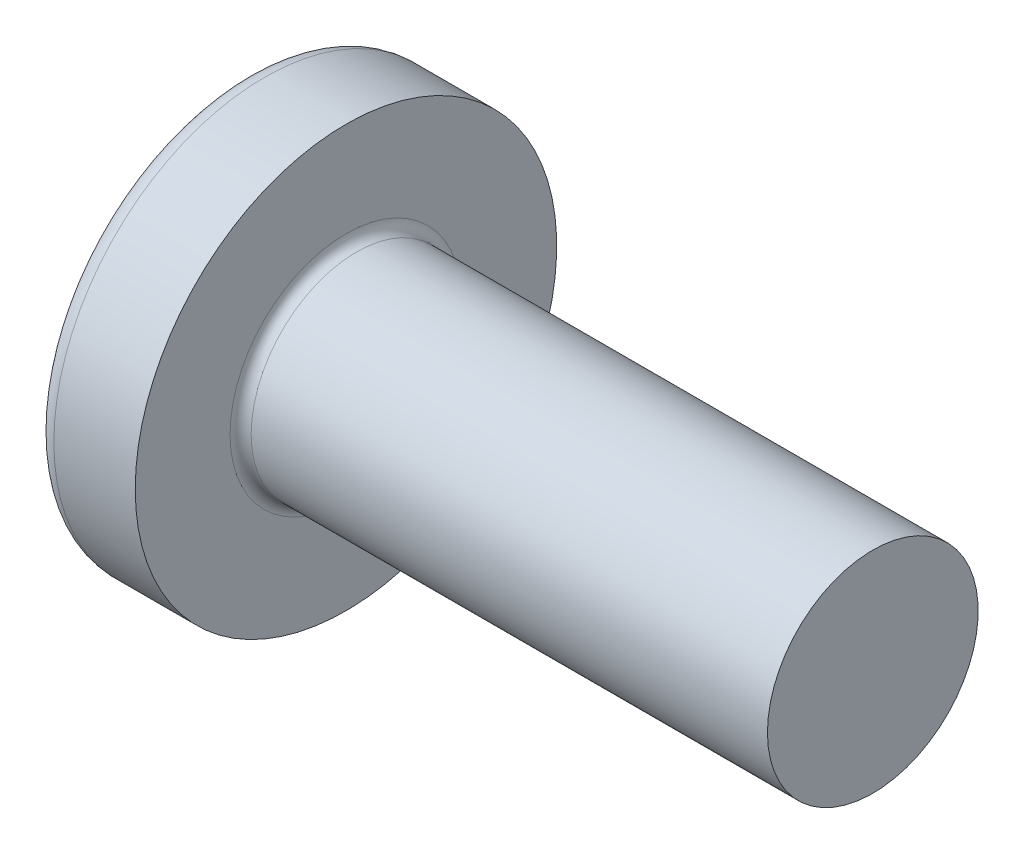
ISO-10303-21;
HEADER;
FILE_DESCRIPTION(('STEP AP214'),'2;1');
FILE_NAME('part.step','',(''),(''),'','','');
FILE_SCHEMA(('AUTOMOTIVE_DESIGN { 1 0 10303 214 1 1 1 1 }'));
ENDSEC;
DATA;
#1=APPLICATION_CONTEXT('core data for automotive mechanical design processes');
#2=APPLICATION_PROTOCOL_DEFINITION('international standard','automotive_design',2000,#1);
#3=PRODUCT_CONTEXT('',#1,'mechanical');
#4=PRODUCT('Part','Part','',(#3));
#5=PRODUCT_RELATED_PRODUCT_CATEGORY('part','',(#4));
#6=PRODUCT_DEFINITION_FORMATION('','',#4);
#7=PRODUCT_DEFINITION_CONTEXT('part definition',#1,'design');
#8=PRODUCT_DEFINITION('design','',#6,#7);
#9=PRODUCT_DEFINITION_SHAPE('','',#8);
#10=(LENGTH_UNIT() NAMED_UNIT(*) SI_UNIT(.MILLI.,.METRE.));
#11=(NAMED_UNIT(*) PLANE_ANGLE_UNIT() SI_UNIT($,.RADIAN.));
#12=(NAMED_UNIT(*) SI_UNIT($,.STERADIAN.) SOLID_ANGLE_UNIT());
#13=UNCERTAINTY_MEASURE_WITH_UNIT(LENGTH_MEASURE(1.E-05),#10,'distance_accuracy_value','');
#14=(GEOMETRIC_REPRESENTATION_CONTEXT(3) GLOBAL_UNCERTAINTY_ASSIGNED_CONTEXT((#13)) GLOBAL_UNIT_ASSIGNED_CONTEXT((#10,
#11,#12)) REPRESENTATION_CONTEXT('',''));
#15=CARTESIAN_POINT('',(0.,0.,0.));
#16=DIRECTION('',(0.,0.,1.));
#17=DIRECTION('',(1.,0.,0.));
#18=AXIS2_PLACEMENT_3D('',#15,#16,#17);
#19=CARTESIAN_POINT('',(6.5,0.,0.));
#20=DIRECTION('',(-1.,0.,0.));
#21=DIRECTION('',(0.,1.,0.));
#22=AXIS2_PLACEMENT_3D('',#19,#20,#21);
#23=SPHERICAL_SURFACE('',#22,6.5);
#24=CARTESIAN_POINT('',(1.26538895452803,0.,0.));
#25=DIRECTION('',(-1.,0.,0.));
#26=DIRECTION('',(0.,0.,1.));
#27=AXIS2_PLACEMENT_3D('',#24,#25,#26);
#28=CIRCLE('',#27,3.85342019543974);
#29=CARTESIAN_POINT('',(1.26538895452803,0.,3.85342019543974));
#30=VERTEX_POINT('',#29);
#31=EDGE_CURVE('E220',#30,#30,#28,.T.);
#32=ORIENTED_EDGE('',*,*,#31,.T.);
#33=EDGE_LOOP('',(#32));
#34=FACE_BOUND('',#33,.T.);
#35=CARTESIAN_POINT('',(0.0788099820016276,0.,0.));
#36=DIRECTION('',(1.,0.,0.));
#37=DIRECTION('',(0.,0.,-1.));
#38=AXIS2_PLACEMENT_3D('',#35,#36,#37);
#39=CIRCLE('',#38,1.0091178091571);
#40=CARTESIAN_POINT('',(0.0788099820016247,-0.514999999999996,-0.867809744562728));
#41=VERTEX_POINT('',#40);
#42=CARTESIAN_POINT('',(0.0788099820016271,-0.867809744562737,-0.515));
#43=VERTEX_POINT('',#42);
#44=EDGE_CURVE('E347',#41,#43,#39,.F.);
#45=ORIENTED_EDGE('',*,*,#44,.F.);
#46=CARTESIAN_POINT('',(6.5,-0.515,0.));
#47=DIRECTION('',(0.,1.,0.));
#48=DIRECTION('',(0.,0.,1.));
#49=AXIS2_PLACEMENT_3D('',#46,#47,#48);
#50=CIRCLE('',#49,6.47956595768575);
#51=CARTESIAN_POINT('',(0.331830520157865,-0.514999999999992,-1.98455543332606));
#52=VERTEX_POINT('',#51);
#53=EDGE_CURVE('E280',#52,#41,#50,.T.);
#54=ORIENTED_EDGE('',*,*,#53,.F.);
#55=CARTESIAN_POINT('',(6.06443225879636,0.,0.873613881877687));
#56=DIRECTION('',(0.446197753347362,0.,-0.89493439139848));
#57=DIRECTION('',(-0.89493439139848,0.,-0.446197753347362));
#58=AXIS2_PLACEMENT_3D('',#55,#56,#57);
#59=CIRCLE('',#58,6.42628038045442);
#60=CARTESIAN_POINT('',(0.331830520157865,0.515000000000007,-1.98455543332606));
#61=VERTEX_POINT('',#60);
#62=EDGE_CURVE('E254',#52,#61,#59,.T.);
#63=ORIENTED_EDGE('',*,*,#62,.T.);
#64=CARTESIAN_POINT('',(6.5,0.515,0.));
#65=DIRECTION('',(0.,-1.,0.));
#66=DIRECTION('',(0.,0.,-1.));
#67=AXIS2_PLACEMENT_3D('',#64,#65,#66);
#68=CIRCLE('',#67,6.47956595768575);
#69=CARTESIAN_POINT('',(0.0788099820016249,0.515000000000003,-0.867809744562724));
#70=VERTEX_POINT('',#69);
#71=EDGE_CURVE('E309',#70,#61,#68,.T.);
#72=ORIENTED_EDGE('',*,*,#71,.F.);
#73=CARTESIAN_POINT('',(0.0788099820016271,0.867809744562734,-0.515));
#74=VERTEX_POINT('',#73);
#75=EDGE_CURVE('E362',#74,#70,#39,.F.);
#76=ORIENTED_EDGE('',*,*,#75,.F.);
#77=CARTESIAN_POINT('',(6.5,0.,-0.515));
#78=DIRECTION('',(0.,0.,1.));
#79=DIRECTION('',(0.,-1.,0.));
#80=AXIS2_PLACEMENT_3D('',#77,#78,#79);
#81=CIRCLE('',#80,6.47956595768575);
#82=CARTESIAN_POINT('',(0.331830520157846,1.984555433326,-0.515));
#83=VERTEX_POINT('',#82);
#84=EDGE_CURVE('E248',#83,#74,#81,.T.);
#85=ORIENTED_EDGE('',*,*,#84,.F.);
#86=CARTESIAN_POINT('',(6.06443225879571,-0.87361388187862,0.));
#87=DIRECTION('',(0.44619775334751,0.894934391398406,0.));
#88=DIRECTION('',(-0.894934391398405,0.44619775334751,0.));
#89=AXIS2_PLACEMENT_3D('',#86,#87,#88);
#90=CIRCLE('',#89,6.42628038045425);
#91=CARTESIAN_POINT('',(0.331830520157846,1.984555433326,0.515));
#92=VERTEX_POINT('',#91);
#93=EDGE_CURVE('E251',#83,#92,#90,.T.);
#94=ORIENTED_EDGE('',*,*,#93,.T.);
#95=CARTESIAN_POINT('',(6.5,0.,0.515));
#96=DIRECTION('',(0.,0.,-1.));
#97=DIRECTION('',(0.,1.,0.));
#98=AXIS2_PLACEMENT_3D('',#95,#96,#97);
#99=CIRCLE('',#98,6.47956595768575);
#100=CARTESIAN_POINT('',(0.0788099820016271,0.867809744562734,0.515));
#101=VERTEX_POINT('',#100);
#102=EDGE_CURVE('E244',#101,#92,#99,.T.);
#103=ORIENTED_EDGE('',*,*,#102,.F.);
#104=CARTESIAN_POINT('',(0.0788099820016247,0.514999999999997,0.867809744562727));
#105=VERTEX_POINT('',#104);
#106=EDGE_CURVE('E361',#105,#101,#39,.F.);
#107=ORIENTED_EDGE('',*,*,#106,.F.);
#108=CARTESIAN_POINT('',(0.331830520157846,0.514999999999993,1.984555433326));
#109=VERTEX_POINT('',#108);
#110=EDGE_CURVE('E264',#109,#105,#68,.T.);
#111=ORIENTED_EDGE('',*,*,#110,.F.);
#112=CARTESIAN_POINT('',(6.06443225879571,0.,-0.87361388187862));
#113=DIRECTION('',(0.44619775334751,0.,0.894934391398406));
#114=DIRECTION('',(0.894934391398405,0.,-0.44619775334751));
#115=AXIS2_PLACEMENT_3D('',#112,#113,#114);
#116=CIRCLE('',#115,6.42628038045425);
#117=CARTESIAN_POINT('',(0.331830520157846,-0.515000000000007,1.984555433326));
#118=VERTEX_POINT('',#117);
#119=EDGE_CURVE('E55',#109,#118,#116,.T.);
#120=ORIENTED_EDGE('',*,*,#119,.T.);
#121=CARTESIAN_POINT('',(0.078809982001625,-0.515000000000003,0.867809744562724));
#122=VERTEX_POINT('',#121);
#123=EDGE_CURVE('E261',#122,#118,#50,.T.);
#124=ORIENTED_EDGE('',*,*,#123,.F.);
#125=CARTESIAN_POINT('',(0.0788099820016271,-0.867809744562737,0.514999999999999));
#126=VERTEX_POINT('',#125);
#127=EDGE_CURVE('E397',#126,#122,#39,.F.);
#128=ORIENTED_EDGE('',*,*,#127,.F.);
#129=CARTESIAN_POINT('',(0.331830520157864,-1.98455543332606,0.514999999999999));
#130=VERTEX_POINT('',#129);
#131=EDGE_CURVE('E245',#130,#126,#99,.T.);
#132=ORIENTED_EDGE('',*,*,#131,.F.);
#133=CARTESIAN_POINT('',(6.06443225879636,0.873613881877687,0.));
#134=DIRECTION('',(0.446197753347362,-0.89493439139848,0.));
#135=DIRECTION('',(0.89493439139848,0.446197753347362,0.));
#136=AXIS2_PLACEMENT_3D('',#133,#134,#135);
#137=CIRCLE('',#136,6.42628038045442);
#138=CARTESIAN_POINT('',(0.331830520157864,-1.98455543332606,-0.515));
#139=VERTEX_POINT('',#138);
#140=EDGE_CURVE('E241',#130,#139,#137,.T.);
#141=ORIENTED_EDGE('',*,*,#140,.T.);
#142=EDGE_CURVE('E70',#43,#139,#81,.T.);
#143=ORIENTED_EDGE('',*,*,#142,.F.);
#144=EDGE_LOOP('',(#45,#54,#63,#72,#76,#85,#94,#103,#107,#111,#120,#124,#128,#132,#141,#143));
#145=FACE_BOUND('',#144,.T.);
#146=ADVANCED_FACE('F41',(#34,#145),#23,.T.);
#147=CARTESIAN_POINT('',(0.,2.15,-0.515));
#148=DIRECTION('',(0.,0.,1.));
#149=DIRECTION('',(0.,-1.,0.));
#150=AXIS2_PLACEMENT_3D('',#147,#148,#149);
#151=PLANE('',#150);
#152=ORIENTED_EDGE('',*,*,#84,.T.);
#153=CARTESIAN_POINT('',(-1.51195208754037,0.994972220382297,-0.515));
#154=CARTESIAN_POINT('',(-1.20405982018868,0.970722017005064,-0.515));
#155=CARTESIAN_POINT('',(-0.896180908124144,0.946299109967688,-0.515));
#156=CARTESIAN_POINT('',(-0.280449080249312,0.896981122461527,-0.515));
#157=CARTESIAN_POINT('',(0.0274038341154851,0.872086023961265,-0.515));
#158=CARTESIAN_POINT('',(0.489146739371409,0.834295535207136,-0.515));
#159=CARTESIAN_POINT('',(0.643055047497245,0.821624058408796,-0.515));
#160=CARTESIAN_POINT('',(0.950856520315203,0.796108332629705,-0.515));
#161=CARTESIAN_POINT('',(1.10474968508407,0.783264084575317,-0.515));
#162=CARTESIAN_POINT('',(1.41251352133103,0.757376569061287,-0.515));
#163=CARTESIAN_POINT('',(1.56638419343305,0.744333309025534,-0.515));
#164=CARTESIAN_POINT('',(1.87410847407519,0.718013273133716,-0.515));
#165=CARTESIAN_POINT('',(2.02796208224283,0.704736492919709,-0.515));
#166=CARTESIAN_POINT('',(2.36455311972626,0.675386942934955,-0.515));
#167=CARTESIAN_POINT('',(2.5472856237498,0.659257575568568,-0.515));
#168=CARTESIAN_POINT('',(2.91270624190895,0.626517182406014,-0.515));
#169=CARTESIAN_POINT('',(3.09539435635676,0.609906160102554,-0.515));
#170=CARTESIAN_POINT('',(3.46069832273244,0.576073027039889,-0.515));
#171=CARTESIAN_POINT('',(3.64331417951694,0.558850968855157,-0.515));
#172=CARTESIAN_POINT('',(4.00847437578178,0.523604864460044,-0.515));
#173=CARTESIAN_POINT('',(4.1910187129849,0.505580794522876,-0.515));
#174=CARTESIAN_POINT('',(4.55606208239525,0.46842919158178,-0.515));
#175=CARTESIAN_POINT('',(4.73856107439606,0.449301262195198,-0.515));
#176=CARTESIAN_POINT('',(5.10337547434977,0.409473604657435,-0.515));
#177=CARTESIAN_POINT('',(5.2856908960796,0.388774005011695,-0.515));
#178=CARTESIAN_POINT('',(5.55897278576906,0.355828287427083,-0.515));
#179=CARTESIAN_POINT('',(5.65005277501166,0.344527918680369,-0.515));
#180=CARTESIAN_POINT('',(5.83209904185046,0.3210751741555,-0.515));
#181=CARTESIAN_POINT('',(5.92306532479326,0.308922840099181,-0.515));
#182=CARTESIAN_POINT('',(6.10486078954238,0.283427334334153,-0.515));
#183=CARTESIAN_POINT('',(6.19568992380675,0.270083817479638,-0.515));
#184=CARTESIAN_POINT('',(6.33172773866873,0.24870142067948,-0.515));
#185=CARTESIAN_POINT('',(6.37704304554499,0.241345446571708,-0.515));
#186=CARTESIAN_POINT('',(6.46757225282465,0.226018953418424,-0.515));
#187=CARTESIAN_POINT('',(6.51278614649077,0.218048394719369,-0.515));
#188=CARTESIAN_POINT('',(6.55793125840465,0.209691465124902,-0.515));
#189=B_SPLINE_CURVE_WITH_KNOTS('',3,(#153,#154,#155,#156,#157,#158,#159,#160,#161,#162,#163,
#164,#165,#166,#167,#168,#169,#170,#171,#172,#173,#174,#175,#176,#177,#178,#179,#180,#181,#182,
#183,#184,#185,#186,#187,#188),.UNSPECIFIED.,.F.,.F.,(4,2,2,2,2,2,2,2,2,2,2,2,2,2,2,2,2,4),(0.,
0.926537710061278,1.85311087314258,2.31639796098494,2.77968256577269,3.24294993036838,
3.70622594962848,4.25655436226469,4.80687878520654,5.3571559716686,5.90744944841854,
6.45794177358856,7.00838913688618,7.28372117498156,7.55903973911883,7.83443833749095,
7.97216007622235,8.10989070832989),.UNSPECIFIED.);
#190=CARTESIAN_POINT('',(2.34,0.677477674908923,-0.515));
#191=VERTEX_POINT('',#190);
#192=EDGE_CURVE('E384',#74,#191,#189,.T.);
#193=ORIENTED_EDGE('',*,*,#192,.T.);
#194=DIRECTION('',(0.,1.,0.));
#195=VECTOR('',#194,1.);
#196=CARTESIAN_POINT('',(2.34,-0.983319232260985,-0.515));
#197=LINE('',#196,#195);
#198=CARTESIAN_POINT('',(2.34,0.9833192322605,-0.515));
#199=VERTEX_POINT('',#198);
#200=EDGE_CURVE('E330',#191,#199,#197,.T.);
#201=ORIENTED_EDGE('',*,*,#200,.T.);
#202=DIRECTION('',(0.894934391398405,-0.44619775334751,0.));
#203=VECTOR('',#202,1.);
#204=CARTESIAN_POINT('',(0.,2.15,-0.515));
#205=LINE('',#204,#203);
#206=EDGE_CURVE('E221',#83,#199,#205,.T.);
#207=ORIENTED_EDGE('',*,*,#206,.F.);
#208=EDGE_LOOP('',(#152,#193,#201,#207));
#209=FACE_BOUND('',#208,.T.);
#210=ADVANCED_FACE('F176',(#209),#151,.T.);
#211=CARTESIAN_POINT('',(2.34,-0.983319232260985,-0.515));
#212=VERTEX_POINT('',#211);
#213=CARTESIAN_POINT('',(2.34,-0.677477674908923,-0.515));
#214=VERTEX_POINT('',#213);
#215=EDGE_CURVE('E229',#212,#214,#197,.T.);
#216=ORIENTED_EDGE('',*,*,#215,.T.);
#217=CARTESIAN_POINT('',(-1.51195208675156,-0.994972220320187,-0.515));
#218=CARTESIAN_POINT('',(-1.20405981949279,-0.970722016949958,-0.515));
#219=CARTESIAN_POINT('',(-0.896180907521173,-0.946299109919651,-0.515));
#220=CARTESIAN_POINT('',(-0.280449079832185,-0.896981122427851,-0.515));
#221=CARTESIAN_POINT('',(0.0274038344396873,-0.872086023934883,-0.515));
#222=CARTESIAN_POINT('',(0.489146739515351,-0.83429553519528,-0.515));
#223=CARTESIAN_POINT('',(0.643055047553846,-0.821624058404092,-0.515));
#224=CARTESIAN_POINT('',(0.950856520197141,-0.796108332639504,-0.515));
#225=CARTESIAN_POINT('',(1.10474968487868,-0.783264084592465,-0.515));
#226=CARTESIAN_POINT('',(1.41251352095103,-0.757376569093378,-0.515));
#227=CARTESIAN_POINT('',(1.56638419296577,-0.744333309065218,-0.515));
#228=CARTESIAN_POINT('',(1.87410847343335,-0.718013273188896,-0.515));
#229=CARTESIAN_POINT('',(2.02796208151372,-0.704736492982792,-0.515));
#230=CARTESIAN_POINT('',(2.36455311890989,-0.675386943006726,-0.515));
#231=CARTESIAN_POINT('',(2.54728562293342,-0.659257575640986,-0.515));
#232=CARTESIAN_POINT('',(2.91270624109256,-0.626517182479888,-0.515));
#233=CARTESIAN_POINT('',(3.09539435554038,-0.609906160177238,-0.515));
#234=CARTESIAN_POINT('',(3.46069832191613,-0.576073027116421,-0.515));
#235=CARTESIAN_POINT('',(3.64331417870068,-0.558850968932727,-0.515));
#236=CARTESIAN_POINT('',(4.00847437496567,-0.523604864540037,-0.515));
#237=CARTESIAN_POINT('',(4.19101871216888,-0.505580794604253,-0.515));
#238=CARTESIAN_POINT('',(4.55606208157937,-0.468429191666488,-0.515));
#239=CARTESIAN_POINT('',(4.73856107358023,-0.449301262281853,-0.515));
#240=CARTESIAN_POINT('',(5.10337547353419,-0.409473604748924,-0.515));
#241=CARTESIAN_POINT('',(5.28569089526422,-0.388774005106069,-0.515));
#242=CARTESIAN_POINT('',(5.55897278495412,-0.355828287527264,-0.515));
#243=CARTESIAN_POINT('',(5.65005277419686,-0.344527918782738,-0.515));
#244=CARTESIAN_POINT('',(5.83209904103608,-0.321075174263031,-0.515));
#245=CARTESIAN_POINT('',(5.92306532397915,-0.308922840209686,-0.515));
#246=CARTESIAN_POINT('',(6.10486078872898,-0.28342733445193,-0.515));
#247=CARTESIAN_POINT('',(6.1956899229938,-0.270083817601714,-0.515));
#248=CARTESIAN_POINT('',(6.33172773785679,-0.248701420809951,-0.515));
#249=CARTESIAN_POINT('',(6.37704304473344,-0.241345446705304,-0.515));
#250=CARTESIAN_POINT('',(6.4675722520141,-0.226018953559338,-0.515));
#251=CARTESIAN_POINT('',(6.51278614568083,-0.218048394864476,-0.515));
#252=CARTESIAN_POINT('',(6.55793125759549,-0.209691465274944,-0.515));
#253=B_SPLINE_CURVE_WITH_KNOTS('',3,(#217,#218,#219,#220,#221,#222,#223,#224,#225,#226,#227,
#228,#229,#230,#231,#232,#233,#234,#235,#236,#237,#238,#239,#240,#241,#242,#243,#244,#245,#246,
#247,#248,#249,#250,#251,#252),.UNSPECIFIED.,.F.,.F.,(4,2,2,2,2,2,2,2,2,2,2,2,2,2,2,2,2,4),(0.,
0.92653770978172,1.85311087258339,2.31639796016285,2.77968256468771,3.24294992902054,
3.70622594801777,4.25655436065378,4.80687878359543,5.35715597005738,5.90744944680718,
6.45794177197673,7.008389135274,7.28372117336899,7.55903973750591,7.83443833587749,
7.97216007460855,8.10989070671571),.UNSPECIFIED.);
#254=EDGE_CURVE('E360',#214,#43,#253,.F.);
#255=ORIENTED_EDGE('',*,*,#254,.T.);
#256=ORIENTED_EDGE('',*,*,#142,.T.);
#257=DIRECTION('',(0.894934391398479,0.446197753347362,0.));
#258=VECTOR('',#257,1.);
#259=CARTESIAN_POINT('',(0.,-2.15,-0.515));
#260=LINE('',#259,#258);
#261=EDGE_CURVE('E312',#139,#212,#260,.T.);
#262=ORIENTED_EDGE('',*,*,#261,.T.);
#263=EDGE_LOOP('',(#216,#255,#256,#262));
#264=FACE_BOUND('',#263,.T.);
#265=ADVANCED_FACE('F182',(#264),#151,.T.);
#266=CARTESIAN_POINT('',(0.,-2.15,0.514999999999999));
#267=DIRECTION('',(0.,0.,-1.));
#268=DIRECTION('',(0.,1.,0.));
#269=AXIS2_PLACEMENT_3D('',#266,#267,#268);
#270=PLANE('',#269);
#271=DIRECTION('',(0.,-1.,0.));
#272=VECTOR('',#271,1.);
#273=CARTESIAN_POINT('',(2.34,0.9833192322605,0.515));
#274=LINE('',#273,#272);
#275=CARTESIAN_POINT('',(2.34,0.9833192322605,0.515));
#276=VERTEX_POINT('',#275);
#277=CARTESIAN_POINT('',(2.34,0.677477674908923,0.515));
#278=VERTEX_POINT('',#277);
#279=EDGE_CURVE('E320',#276,#278,#274,.T.);
#280=ORIENTED_EDGE('',*,*,#279,.T.);
#281=CARTESIAN_POINT('',(-1.51195208754037,0.994972220382298,0.515));
#282=CARTESIAN_POINT('',(-1.20405982018868,0.970722017005064,0.514999999999999));
#283=CARTESIAN_POINT('',(-0.896180908124144,0.946299109967689,0.515));
#284=CARTESIAN_POINT('',(-0.280449080249312,0.896981122461527,0.515));
#285=CARTESIAN_POINT('',(0.0274038341154852,0.872086023961265,0.515));
#286=CARTESIAN_POINT('',(0.489146739371409,0.834295535207136,0.515));
#287=CARTESIAN_POINT('',(0.643055047497245,0.821624058408796,0.515));
#288=CARTESIAN_POINT('',(0.950856520315204,0.796108332629706,0.515));
#289=CARTESIAN_POINT('',(1.10474968508407,0.783264084575317,0.515));
#290=CARTESIAN_POINT('',(1.41251352133103,0.757376569061287,0.515));
#291=CARTESIAN_POINT('',(1.56638419343305,0.744333309025534,0.515));
#292=CARTESIAN_POINT('',(1.87410847407519,0.718013273133716,0.515));
#293=CARTESIAN_POINT('',(2.02796208224283,0.70473649291971,0.515));
#294=CARTESIAN_POINT('',(2.36455311972626,0.675386942934956,0.515));
#295=CARTESIAN_POINT('',(2.5472856237498,0.659257575568568,0.515));
#296=CARTESIAN_POINT('',(2.91270624190895,0.626517182406014,0.515));
#297=CARTESIAN_POINT('',(3.09539435635676,0.609906160102555,0.515));
#298=CARTESIAN_POINT('',(3.46069832273244,0.576073027039889,0.515));
#299=CARTESIAN_POINT('',(3.64331417951694,0.558850968855157,0.515));
#300=CARTESIAN_POINT('',(4.00847437578178,0.523604864460044,0.515));
#301=CARTESIAN_POINT('',(4.1910187129849,0.505580794522876,0.515));
#302=CARTESIAN_POINT('',(4.55606208239526,0.46842919158178,0.515));
#303=CARTESIAN_POINT('',(4.73856107439606,0.449301262195198,0.515));
#304=CARTESIAN_POINT('',(5.10337547434977,0.409473604657435,0.515));
#305=CARTESIAN_POINT('',(5.28569089607961,0.388774005011695,0.515));
#306=CARTESIAN_POINT('',(5.55897278576906,0.355828287427082,0.515));
#307=CARTESIAN_POINT('',(5.65005277501166,0.344527918680369,0.515));
#308=CARTESIAN_POINT('',(5.83209904185046,0.3210751741555,0.515));
#309=CARTESIAN_POINT('',(5.92306532479326,0.308922840099181,0.515));
#310=CARTESIAN_POINT('',(6.10486078954238,0.283427334334153,0.515));
#311=CARTESIAN_POINT('',(6.19568992380676,0.270083817479637,0.515));
#312=CARTESIAN_POINT('',(6.33172773866874,0.248701420679479,0.515));
#313=CARTESIAN_POINT('',(6.377043045545,0.241345446571707,0.515));
#314=CARTESIAN_POINT('',(6.46757225282466,0.226018953418423,0.515));
#315=CARTESIAN_POINT('',(6.51278614649077,0.218048394719368,0.515));
#316=CARTESIAN_POINT('',(6.55793125840465,0.209691465124901,0.515));
#317=B_SPLINE_CURVE_WITH_KNOTS('',3,(#281,#282,#283,#284,#285,#286,#287,#288,#289,#290,#291,
#292,#293,#294,#295,#296,#297,#298,#299,#300,#301,#302,#303,#304,#305,#306,#307,#308,#309,#310,
#311,#312,#313,#314,#315,#316),.UNSPECIFIED.,.F.,.F.,(4,2,2,2,2,2,2,2,2,2,2,2,2,2,2,2,2,4),(0.,
0.926537710061278,1.85311087314258,2.31639796098494,2.77968256577269,3.24294993036838,
3.70622594962848,4.25655436226469,4.80687878520654,5.3571559716686,5.90744944841855,
6.45794177358856,7.00838913688619,7.28372117498157,7.55903973911884,7.83443833749096,
7.97216007622236,8.10989070832989),.UNSPECIFIED.);
#318=EDGE_CURVE('E285',#278,#101,#317,.F.);
#319=ORIENTED_EDGE('',*,*,#318,.T.);
#320=ORIENTED_EDGE('',*,*,#102,.T.);
#321=DIRECTION('',(0.894934391398405,-0.44619775334751,0.));
#322=VECTOR('',#321,1.);
#323=CARTESIAN_POINT('',(0.,2.15,0.515));
#324=LINE('',#323,#322);
#325=EDGE_CURVE('E226',#92,#276,#324,.T.);
#326=ORIENTED_EDGE('',*,*,#325,.T.);
#327=EDGE_LOOP('',(#280,#319,#320,#326));
#328=FACE_BOUND('',#327,.T.);
#329=ADVANCED_FACE('F380',(#328),#270,.T.);
#330=ORIENTED_EDGE('',*,*,#131,.T.);
#331=CARTESIAN_POINT('',(-1.51195208754037,-0.994972220382298,0.514999999999999));
#332=CARTESIAN_POINT('',(-1.20405982018868,-0.970722017005064,0.514999999999999));
#333=CARTESIAN_POINT('',(-0.896180908124144,-0.946299109967689,0.514999999999999));
#334=CARTESIAN_POINT('',(-0.280449080249312,-0.896981122461527,0.514999999999999));
#335=CARTESIAN_POINT('',(0.0274038341154852,-0.872086023961265,0.514999999999999));
#336=CARTESIAN_POINT('',(0.489146739371409,-0.834295535207137,0.514999999999999));
#337=CARTESIAN_POINT('',(0.643055047497245,-0.821624058408796,0.514999999999999));
#338=CARTESIAN_POINT('',(0.950856520315204,-0.796108332629706,0.514999999999999));
#339=CARTESIAN_POINT('',(1.10474968508407,-0.783264084575317,0.514999999999999));
#340=CARTESIAN_POINT('',(1.41251352133103,-0.757376569061288,0.514999999999999));
#341=CARTESIAN_POINT('',(1.56638419343305,-0.744333309025534,0.515));
#342=CARTESIAN_POINT('',(1.87410847407519,-0.718013273133716,0.515));
#343=CARTESIAN_POINT('',(2.02796208224283,-0.70473649291971,0.515));
#344=CARTESIAN_POINT('',(2.36455311972626,-0.675386942934956,0.515));
#345=CARTESIAN_POINT('',(2.5472856237498,-0.659257575568568,0.515));
#346=CARTESIAN_POINT('',(2.91270624190895,-0.626517182406014,0.515));
#347=CARTESIAN_POINT('',(3.09539435635676,-0.609906160102555,0.515));
#348=CARTESIAN_POINT('',(3.46069832273244,-0.57607302703989,0.515));
#349=CARTESIAN_POINT('',(3.64331417951693,-0.558850968855157,0.515));
#350=CARTESIAN_POINT('',(4.00847437578178,-0.523604864460045,0.515));
#351=CARTESIAN_POINT('',(4.1910187129849,-0.505580794522877,0.515));
#352=CARTESIAN_POINT('',(4.55606208239525,-0.468429191581781,0.515));
#353=CARTESIAN_POINT('',(4.73856107439606,-0.449301262195198,0.515));
#354=CARTESIAN_POINT('',(5.10337547434977,-0.409473604657435,0.515));
#355=CARTESIAN_POINT('',(5.2856908960796,-0.388774005011696,0.515));
#356=CARTESIAN_POINT('',(5.55897278576906,-0.355828287427083,0.515));
#357=CARTESIAN_POINT('',(5.65005277501166,-0.344527918680369,0.515));
#358=CARTESIAN_POINT('',(5.83209904185046,-0.3210751741555,0.515));
#359=CARTESIAN_POINT('',(5.92306532479326,-0.308922840099181,0.515));
#360=CARTESIAN_POINT('',(6.10486078954238,-0.283427334334153,0.515));
#361=CARTESIAN_POINT('',(6.19568992380675,-0.270083817479638,0.515));
#362=CARTESIAN_POINT('',(6.33172773866873,-0.24870142067948,0.515));
#363=CARTESIAN_POINT('',(6.37704304554499,-0.241345446571708,0.515));
#364=CARTESIAN_POINT('',(6.46757225282465,-0.226018953418424,0.515));
#365=CARTESIAN_POINT('',(6.51278614649077,-0.218048394719369,0.515));
#366=CARTESIAN_POINT('',(6.55793125840465,-0.209691465124902,0.515));
#367=B_SPLINE_CURVE_WITH_KNOTS('',3,(#331,#332,#333,#334,#335,#336,#337,#338,#339,#340,#341,
#342,#343,#344,#345,#346,#347,#348,#349,#350,#351,#352,#353,#354,#355,#356,#357,#358,#359,#360,
#361,#362,#363,#364,#365,#366),.UNSPECIFIED.,.F.,.F.,(4,2,2,2,2,2,2,2,2,2,2,2,2,2,2,2,2,4),(0.,
0.926537710061278,1.85311087314258,2.31639796098494,2.77968256577269,3.24294993036838,
3.70622594962848,4.25655436226469,4.80687878520654,5.3571559716686,5.90744944841854,
6.45794177358856,7.00838913688618,7.28372117498156,7.55903973911884,7.83443833749096,
7.97216007622236,8.10989070832989),.UNSPECIFIED.);
#368=CARTESIAN_POINT('',(2.34,-0.677477674908923,0.515));
#369=VERTEX_POINT('',#368);
#370=EDGE_CURVE('E398',#126,#369,#367,.T.);
#371=ORIENTED_EDGE('',*,*,#370,.T.);
#372=CARTESIAN_POINT('',(2.34,-0.983319232260985,0.515));
#373=VERTEX_POINT('',#372);
#374=EDGE_CURVE('E322',#369,#373,#274,.T.);
#375=ORIENTED_EDGE('',*,*,#374,.T.);
#376=DIRECTION('',(0.89493439139848,0.446197753347362,0.));
#377=VECTOR('',#376,1.);
#378=CARTESIAN_POINT('',(0.,-2.15,0.514999999999999));
#379=LINE('',#378,#377);
#380=EDGE_CURVE('E314',#130,#373,#379,.T.);
#381=ORIENTED_EDGE('',*,*,#380,.F.);
#382=EDGE_LOOP('',(#330,#371,#375,#381));
#383=FACE_BOUND('',#382,.T.);
#384=ADVANCED_FACE('F428',(#383),#270,.T.);
#385=CARTESIAN_POINT('',(2.34,0.9833192322605,-0.515));
#386=DIRECTION('',(-1.,0.,0.));
#387=DIRECTION('',(0.,0.,1.));
#388=AXIS2_PLACEMENT_3D('',#385,#386,#387);
#389=PLANE('',#388);
#390=ORIENTED_EDGE('',*,*,#374,.F.);
#391=CARTESIAN_POINT('',(2.34,0.,0.));
#392=DIRECTION('',(-1.,0.,0.));
#393=DIRECTION('',(0.,0.,1.));
#394=AXIS2_PLACEMENT_3D('',#391,#392,#393);
#395=CIRCLE('',#394,0.851);
#396=EDGE_CURVE('E355',#214,#369,#395,.T.);
#397=ORIENTED_EDGE('',*,*,#396,.F.);
#398=ORIENTED_EDGE('',*,*,#215,.F.);
#399=DIRECTION('',(0.,0.,1.));
#400=VECTOR('',#399,1.);
#401=CARTESIAN_POINT('',(2.34,-0.983319232260985,-0.515));
#402=LINE('',#401,#400);
#403=EDGE_CURVE('E317',#212,#373,#402,.T.);
#404=ORIENTED_EDGE('',*,*,#403,.T.);
#405=EDGE_LOOP('',(#390,#397,#398,#404));
#406=FACE_BOUND('',#405,.T.);
#407=ADVANCED_FACE('F421',(#406),#389,.T.);
#408=DIRECTION('',(0.,0.,-1.));
#409=VECTOR('',#408,1.);
#410=CARTESIAN_POINT('',(2.34,-0.515000000000003,0.983319232260498));
#411=LINE('',#410,#409);
#412=CARTESIAN_POINT('',(2.34,-0.514999999999997,-0.677477674908925));
#413=VERTEX_POINT('',#412);
#414=CARTESIAN_POINT('',(2.34,-0.514999999999996,-0.983319232260987));
#415=VERTEX_POINT('',#414);
#416=EDGE_CURVE('E303',#413,#415,#411,.T.);
#417=ORIENTED_EDGE('',*,*,#416,.F.);
#418=CARTESIAN_POINT('',(2.34,0.515000000000002,-0.677477674908921));
#419=VERTEX_POINT('',#418);
#420=EDGE_CURVE('E62',#419,#413,#395,.T.);
#421=ORIENTED_EDGE('',*,*,#420,.F.);
#422=DIRECTION('',(0.,0.,1.));
#423=VECTOR('',#422,1.);
#424=CARTESIAN_POINT('',(2.34,0.515000000000004,-0.983319232260983));
#425=LINE('',#424,#423);
#426=CARTESIAN_POINT('',(2.34,0.515000000000004,-0.983319232260983));
#427=VERTEX_POINT('',#426);
#428=EDGE_CURVE('E306',#427,#419,#425,.T.);
#429=ORIENTED_EDGE('',*,*,#428,.F.);
#430=DIRECTION('',(0.,-1.,0.));
#431=VECTOR('',#430,1.);
#432=CARTESIAN_POINT('',(2.34,0.515000000000004,-0.983319232260983));
#433=LINE('',#432,#431);
#434=EDGE_CURVE('E297',#427,#415,#433,.T.);
#435=ORIENTED_EDGE('',*,*,#434,.T.);
#436=EDGE_LOOP('',(#417,#421,#429,#435));
#437=FACE_BOUND('',#436,.T.);
#438=ADVANCED_FACE('F350',(#437),#389,.T.);
#439=ORIENTED_EDGE('',*,*,#200,.F.);
#440=EDGE_CURVE('E354',#278,#191,#395,.T.);
#441=ORIENTED_EDGE('',*,*,#440,.F.);
#442=ORIENTED_EDGE('',*,*,#279,.F.);
#443=DIRECTION('',(0.,0.,-1.));
#444=VECTOR('',#443,1.);
#445=CARTESIAN_POINT('',(2.34,0.9833192322605,0.515));
#446=LINE('',#445,#444);
#447=EDGE_CURVE('E323',#276,#199,#446,.T.);
#448=ORIENTED_EDGE('',*,*,#447,.T.);
#449=EDGE_LOOP('',(#439,#441,#442,#448));
#450=FACE_BOUND('',#449,.T.);
#451=ADVANCED_FACE('F422',(#450),#389,.T.);
#452=CARTESIAN_POINT('',(0.,0.514999999999993,2.15));
#453=DIRECTION('',(0.,-1.,0.));
#454=DIRECTION('',(0.,0.,-1.));
#455=AXIS2_PLACEMENT_3D('',#452,#453,#454);
#456=PLANE('',#455);
#457=ORIENTED_EDGE('',*,*,#110,.T.);
#458=CARTESIAN_POINT('',(-1.51195208754037,0.514999999999997,0.994972220382299));
#459=CARTESIAN_POINT('',(-1.20405982018868,0.514999999999997,0.970722017005066));
#460=CARTESIAN_POINT('',(-0.896180908124144,0.514999999999997,0.94629910996769));
#461=CARTESIAN_POINT('',(-0.280449080249312,0.514999999999997,0.896981122461529));
#462=CARTESIAN_POINT('',(0.0274038341154852,0.514999999999997,0.872086023961266));
#463=CARTESIAN_POINT('',(0.489146739371409,0.514999999999997,0.834295535207138));
#464=CARTESIAN_POINT('',(0.643055047497245,0.514999999999997,0.821624058408798));
#465=CARTESIAN_POINT('',(0.950856520315203,0.514999999999997,0.796108332629707));
#466=CARTESIAN_POINT('',(1.10474968508407,0.514999999999997,0.783264084575319));
#467=CARTESIAN_POINT('',(1.41251352133103,0.514999999999997,0.757376569061289));
#468=CARTESIAN_POINT('',(1.56638419343305,0.514999999999997,0.744333309025535));
#469=CARTESIAN_POINT('',(1.87410847407519,0.514999999999998,0.718013273133717));
#470=CARTESIAN_POINT('',(2.02796208224283,0.514999999999998,0.704736492919711));
#471=CARTESIAN_POINT('',(2.36455311972626,0.514999999999998,0.675386942934957));
#472=CARTESIAN_POINT('',(2.5472856237498,0.514999999999998,0.65925757556857));
#473=CARTESIAN_POINT('',(2.91270624190895,0.514999999999998,0.626517182406015));
#474=CARTESIAN_POINT('',(3.09539435635676,0.514999999999998,0.609906160102556));
#475=CARTESIAN_POINT('',(3.46069832273244,0.514999999999998,0.576073027039891));
#476=CARTESIAN_POINT('',(3.64331417951694,0.514999999999998,0.558850968855158));
#477=CARTESIAN_POINT('',(4.00847437578178,0.514999999999998,0.523604864460046));
#478=CARTESIAN_POINT('',(4.1910187129849,0.514999999999998,0.505580794522878));
#479=CARTESIAN_POINT('',(4.55606208239526,0.514999999999999,0.468429191581781));
#480=CARTESIAN_POINT('',(4.73856107439606,0.514999999999999,0.449301262195199));
#481=CARTESIAN_POINT('',(5.10337547434977,0.514999999999999,0.409473604657437));
#482=CARTESIAN_POINT('',(5.28569089607961,0.514999999999999,0.388774005011697));
#483=CARTESIAN_POINT('',(5.55897278576906,0.514999999999999,0.355828287427084));
#484=CARTESIAN_POINT('',(5.65005277501166,0.514999999999999,0.344527918680371));
#485=CARTESIAN_POINT('',(5.83209904185046,0.514999999999999,0.321075174155502));
#486=CARTESIAN_POINT('',(5.92306532479326,0.514999999999999,0.308922840099182));
#487=CARTESIAN_POINT('',(6.10486078954238,0.514999999999999,0.283427334334155));
#488=CARTESIAN_POINT('',(6.19568992380676,0.514999999999999,0.27008381747964));
#489=CARTESIAN_POINT('',(6.33172773866873,0.514999999999999,0.248701420679481));
#490=CARTESIAN_POINT('',(6.37704304554499,0.514999999999999,0.24134544657171));
#491=CARTESIAN_POINT('',(6.46757225282465,0.514999999999999,0.226018953418426));
#492=CARTESIAN_POINT('',(6.51278614649077,0.514999999999999,0.218048394719371));
#493=CARTESIAN_POINT('',(6.55793125840465,0.514999999999999,0.209691465124904));
#494=B_SPLINE_CURVE_WITH_KNOTS('',3,(#458,#459,#460,#461,#462,#463,#464,#465,#466,#467,#468,
#469,#470,#471,#472,#473,#474,#475,#476,#477,#478,#479,#480,#481,#482,#483,#484,#485,#486,#487,
#488,#489,#490,#491,#492,#493),.UNSPECIFIED.,.F.,.F.,(4,2,2,2,2,2,2,2,2,2,2,2,2,2,2,2,2,4),(0.,
0.926537710061278,1.85311087314258,2.31639796098494,2.77968256577269,3.24294993036838,
3.70622594962848,4.25655436226469,4.80687878520654,5.3571559716686,5.90744944841855,
6.45794177358856,7.00838913688619,7.28372117498157,7.55903973911884,7.83443833749095,
7.97216007622235,8.10989070832989),.UNSPECIFIED.);
#495=CARTESIAN_POINT('',(2.34,0.514999999999998,0.677477674908924));
#496=VERTEX_POINT('',#495);
#497=EDGE_CURVE('E446',#105,#496,#494,.T.);
#498=ORIENTED_EDGE('',*,*,#497,.T.);
#499=CARTESIAN_POINT('',(2.34,0.514999999999997,0.983319232260502));
#500=VERTEX_POINT('',#499);
#501=EDGE_CURVE('E278',#496,#500,#425,.T.);
#502=ORIENTED_EDGE('',*,*,#501,.T.);
#503=DIRECTION('',(0.894934391398405,0.,-0.44619775334751));
#504=VECTOR('',#503,1.);
#505=CARTESIAN_POINT('',(0.,0.514999999999993,2.15));
#506=LINE('',#505,#504);
#507=EDGE_CURVE('E271',#109,#500,#506,.T.);
#508=ORIENTED_EDGE('',*,*,#507,.F.);
#509=EDGE_LOOP('',(#457,#498,#502,#508));
#510=FACE_BOUND('',#509,.T.);
#511=ADVANCED_FACE('F275',(#510),#456,.T.);
#512=CARTESIAN_POINT('',(0.,-0.514999999999992,-2.15));
#513=DIRECTION('',(0.,1.,0.));
#514=DIRECTION('',(0.,0.,1.));
#515=AXIS2_PLACEMENT_3D('',#512,#513,#514);
#516=PLANE('',#515);
#517=CARTESIAN_POINT('',(2.34,-0.515000000000003,0.983319232260498));
#518=VERTEX_POINT('',#517);
#519=CARTESIAN_POINT('',(2.34,-0.515000000000002,0.677477674908921));
#520=VERTEX_POINT('',#519);
#521=EDGE_CURVE('E300',#518,#520,#411,.T.);
#522=ORIENTED_EDGE('',*,*,#521,.T.);
#523=CARTESIAN_POINT('',(-1.51195208675156,-0.515000000000003,0.994972220320186));
#524=CARTESIAN_POINT('',(-1.20405981949279,-0.515000000000003,0.970722016949956));
#525=CARTESIAN_POINT('',(-0.896180907521174,-0.515000000000003,0.946299109919649));
#526=CARTESIAN_POINT('',(-0.280449079832185,-0.515000000000003,0.89698112242785));
#527=CARTESIAN_POINT('',(0.0274038344396872,-0.515000000000003,0.872086023934881));
#528=CARTESIAN_POINT('',(0.489146739515351,-0.515000000000003,0.834295535195278));
#529=CARTESIAN_POINT('',(0.643055047553846,-0.515000000000003,0.821624058404091));
#530=CARTESIAN_POINT('',(0.95085652019714,-0.515000000000003,0.796108332639502));
#531=CARTESIAN_POINT('',(1.10474968487868,-0.515000000000002,0.783264084592464));
#532=CARTESIAN_POINT('',(1.41251352095103,-0.515000000000002,0.757376569093377));
#533=CARTESIAN_POINT('',(1.56638419296577,-0.515000000000002,0.744333309065216));
#534=CARTESIAN_POINT('',(1.87410847343335,-0.515000000000002,0.718013273188894));
#535=CARTESIAN_POINT('',(2.02796208151372,-0.515000000000002,0.70473649298279));
#536=CARTESIAN_POINT('',(2.36455311890989,-0.515000000000002,0.675386943006725));
#537=CARTESIAN_POINT('',(2.54728562293342,-0.515000000000002,0.659257575640984));
#538=CARTESIAN_POINT('',(2.91270624109256,-0.515000000000002,0.626517182479886));
#539=CARTESIAN_POINT('',(3.09539435554038,-0.515000000000002,0.609906160177236));
#540=CARTESIAN_POINT('',(3.46069832191613,-0.515000000000002,0.57607302711642));
#541=CARTESIAN_POINT('',(3.64331417870068,-0.515000000000002,0.558850968932726));
#542=CARTESIAN_POINT('',(4.00847437496567,-0.515000000000002,0.523604864540036));
#543=CARTESIAN_POINT('',(4.19101871216888,-0.515000000000002,0.505580794604251));
#544=CARTESIAN_POINT('',(4.55606208157937,-0.515000000000002,0.468429191666486));
#545=CARTESIAN_POINT('',(4.73856107358022,-0.515000000000002,0.449301262281852));
#546=CARTESIAN_POINT('',(5.10337547353418,-0.515000000000001,0.409473604748923));
#547=CARTESIAN_POINT('',(5.28569089526422,-0.515000000000001,0.388774005106068));
#548=CARTESIAN_POINT('',(5.55897278495412,-0.515000000000001,0.355828287527262));
#549=CARTESIAN_POINT('',(5.65005277419686,-0.515000000000001,0.344527918782736));
#550=CARTESIAN_POINT('',(5.83209904103608,-0.515000000000001,0.321075174263029));
#551=CARTESIAN_POINT('',(5.92306532397915,-0.515000000000001,0.308922840209684));
#552=CARTESIAN_POINT('',(6.10486078872898,-0.515000000000001,0.283427334451928));
#553=CARTESIAN_POINT('',(6.19568992299379,-0.515000000000001,0.270083817601712));
#554=CARTESIAN_POINT('',(6.33172773785679,-0.515000000000001,0.248701420809949));
#555=CARTESIAN_POINT('',(6.37704304473344,-0.515000000000001,0.241345446705302));
#556=CARTESIAN_POINT('',(6.4675722520141,-0.515000000000001,0.226018953559336));
#557=CARTESIAN_POINT('',(6.51278614568083,-0.515000000000001,0.218048394864474));
#558=CARTESIAN_POINT('',(6.55793125759549,-0.515000000000001,0.209691465274943));
#559=B_SPLINE_CURVE_WITH_KNOTS('',3,(#523,#524,#525,#526,#527,#528,#529,#530,#531,#532,#533,
#534,#535,#536,#537,#538,#539,#540,#541,#542,#543,#544,#545,#546,#547,#548,#549,#550,#551,#552,
#553,#554,#555,#556,#557,#558),.UNSPECIFIED.,.F.,.F.,(4,2,2,2,2,2,2,2,2,2,2,2,2,2,2,2,2,4),(0.,
0.926537709781721,1.85311087258339,2.31639796016285,2.77968256468771,3.24294992902054,
3.70622594801777,4.25655436065378,4.80687878359543,5.35715597005738,5.90744944680718,
6.45794177197673,7.008389135274,7.28372117336899,7.55903973750591,7.83443833587749,
7.97216007460855,8.10989070671571),.UNSPECIFIED.);
#560=EDGE_CURVE('E390',#520,#122,#559,.F.);
#561=ORIENTED_EDGE('',*,*,#560,.T.);
#562=ORIENTED_EDGE('',*,*,#123,.T.);
#563=DIRECTION('',(0.894934391398405,0.,-0.44619775334751));
#564=VECTOR('',#563,1.);
#565=CARTESIAN_POINT('',(0.,-0.515000000000007,2.15));
#566=LINE('',#565,#564);
#567=EDGE_CURVE('E273',#118,#518,#566,.T.);
#568=ORIENTED_EDGE('',*,*,#567,.T.);
#569=EDGE_LOOP('',(#522,#561,#562,#568));
#570=FACE_BOUND('',#569,.T.);
#571=ADVANCED_FACE('F211',(#570),#516,.T.);
#572=ORIENTED_EDGE('',*,*,#428,.T.);
#573=CARTESIAN_POINT('',(-1.51195208754037,0.515000000000003,-0.994972220382295));
#574=CARTESIAN_POINT('',(-1.20405982018868,0.515000000000003,-0.970722017005062));
#575=CARTESIAN_POINT('',(-0.896180908124144,0.515000000000003,-0.946299109967687));
#576=CARTESIAN_POINT('',(-0.280449080249312,0.515000000000003,-0.896981122461525));
#577=CARTESIAN_POINT('',(0.0274038341154851,0.515000000000003,-0.872086023961263));
#578=CARTESIAN_POINT('',(0.489146739371408,0.515000000000003,-0.834295535207134));
#579=CARTESIAN_POINT('',(0.643055047497245,0.515000000000003,-0.821624058408794));
#580=CARTESIAN_POINT('',(0.950856520315203,0.515000000000003,-0.796108332629704));
#581=CARTESIAN_POINT('',(1.10474968508407,0.515000000000003,-0.783264084575316));
#582=CARTESIAN_POINT('',(1.41251352133103,0.515000000000003,-0.757376569061286));
#583=CARTESIAN_POINT('',(1.56638419343305,0.515000000000003,-0.744333309025532));
#584=CARTESIAN_POINT('',(1.87410847407519,0.515000000000002,-0.718013273133714));
#585=CARTESIAN_POINT('',(2.02796208224283,0.515000000000002,-0.704736492919708));
#586=CARTESIAN_POINT('',(2.36455311972626,0.515000000000002,-0.675386942934954));
#587=CARTESIAN_POINT('',(2.5472856237498,0.515000000000002,-0.659257575568566));
#588=CARTESIAN_POINT('',(2.91270624190895,0.515000000000002,-0.626517182406012));
#589=CARTESIAN_POINT('',(3.09539435635676,0.515000000000002,-0.609906160102553));
#590=CARTESIAN_POINT('',(3.46069832273244,0.515000000000002,-0.576073027039888));
#591=CARTESIAN_POINT('',(3.64331417951694,0.515000000000002,-0.558850968855155));
#592=CARTESIAN_POINT('',(4.00847437578178,0.515000000000002,-0.523604864460042));
#593=CARTESIAN_POINT('',(4.1910187129849,0.515000000000002,-0.505580794522874));
#594=CARTESIAN_POINT('',(4.55606208239526,0.515000000000002,-0.468429191581778));
#595=CARTESIAN_POINT('',(4.73856107439606,0.515000000000002,-0.449301262195196));
#596=CARTESIAN_POINT('',(5.10337547434977,0.515000000000001,-0.409473604657433));
#597=CARTESIAN_POINT('',(5.28569089607961,0.515000000000001,-0.388774005011693));
#598=CARTESIAN_POINT('',(5.55897278576906,0.515000000000001,-0.355828287427081));
#599=CARTESIAN_POINT('',(5.65005277501166,0.515000000000001,-0.344527918680367));
#600=CARTESIAN_POINT('',(5.83209904185046,0.515000000000001,-0.321075174155498));
#601=CARTESIAN_POINT('',(5.92306532479326,0.515000000000001,-0.308922840099179));
#602=CARTESIAN_POINT('',(6.10486078954238,0.515000000000001,-0.283427334334151));
#603=CARTESIAN_POINT('',(6.19568992380675,0.515000000000001,-0.270083817479636));
#604=CARTESIAN_POINT('',(6.33172773866873,0.515000000000001,-0.248701420679478));
#605=CARTESIAN_POINT('',(6.37704304554499,0.515000000000001,-0.241345446571706));
#606=CARTESIAN_POINT('',(6.46757225282465,0.515000000000001,-0.226018953418422));
#607=CARTESIAN_POINT('',(6.51278614649077,0.515000000000001,-0.218048394719367));
#608=CARTESIAN_POINT('',(6.55793125840465,0.515000000000001,-0.2096914651249));
#609=B_SPLINE_CURVE_WITH_KNOTS('',3,(#573,#574,#575,#576,#577,#578,#579,#580,#581,#582,#583,
#584,#585,#586,#587,#588,#589,#590,#591,#592,#593,#594,#595,#596,#597,#598,#599,#600,#601,#602,
#603,#604,#605,#606,#607,#608),.UNSPECIFIED.,.F.,.F.,(4,2,2,2,2,2,2,2,2,2,2,2,2,2,2,2,2,4),(0.,
0.926537710061278,1.85311087314258,2.31639796098494,2.77968256577269,3.24294993036838,
3.70622594962848,4.25655436226469,4.80687878520654,5.3571559716686,5.90744944841855,
6.45794177358856,7.00838913688618,7.28372117498156,7.55903973911884,7.83443833749096,
7.97216007622236,8.10989070832989),.UNSPECIFIED.);
#610=EDGE_CURVE('E339',#419,#70,#609,.F.);
#611=ORIENTED_EDGE('',*,*,#610,.T.);
#612=ORIENTED_EDGE('',*,*,#71,.T.);
#613=DIRECTION('',(0.894934391398479,0.,0.446197753347362));
#614=VECTOR('',#613,1.);
#615=CARTESIAN_POINT('',(0.,0.515000000000007,-2.15));
#616=LINE('',#615,#614);
#617=EDGE_CURVE('E282',#61,#427,#616,.T.);
#618=ORIENTED_EDGE('',*,*,#617,.T.);
#619=EDGE_LOOP('',(#572,#611,#612,#618));
#620=FACE_BOUND('',#619,.T.);
#621=ADVANCED_FACE('F209',(#620),#456,.T.);
#622=ORIENTED_EDGE('',*,*,#53,.T.);
#623=CARTESIAN_POINT('',(-1.51195208754037,-0.514999999999996,-0.994972220382299));
#624=CARTESIAN_POINT('',(-1.20405982018868,-0.514999999999996,-0.970722017005066));
#625=CARTESIAN_POINT('',(-0.896180908124144,-0.514999999999996,-0.946299109967691));
#626=CARTESIAN_POINT('',(-0.280449080249312,-0.514999999999996,-0.896981122461529));
#627=CARTESIAN_POINT('',(0.0274038341154855,-0.514999999999996,-0.872086023961267));
#628=CARTESIAN_POINT('',(0.489146739371408,-0.514999999999997,-0.834295535207138));
#629=CARTESIAN_POINT('',(0.643055047497245,-0.514999999999997,-0.821624058408798));
#630=CARTESIAN_POINT('',(0.950856520315203,-0.514999999999997,-0.796108332629708));
#631=CARTESIAN_POINT('',(1.10474968508407,-0.514999999999997,-0.783264084575319));
#632=CARTESIAN_POINT('',(1.41251352133103,-0.514999999999997,-0.757376569061289));
#633=CARTESIAN_POINT('',(1.56638419343305,-0.514999999999997,-0.744333309025536));
#634=CARTESIAN_POINT('',(1.87410847407519,-0.514999999999997,-0.718013273133718));
#635=CARTESIAN_POINT('',(2.02796208224283,-0.514999999999997,-0.704736492919711));
#636=CARTESIAN_POINT('',(2.36455311972626,-0.514999999999997,-0.675386942934958));
#637=CARTESIAN_POINT('',(2.5472856237498,-0.514999999999997,-0.65925757556857));
#638=CARTESIAN_POINT('',(2.91270624190895,-0.514999999999998,-0.626517182406016));
#639=CARTESIAN_POINT('',(3.09539435635676,-0.514999999999998,-0.609906160102557));
#640=CARTESIAN_POINT('',(3.46069832273244,-0.514999999999998,-0.576073027039892));
#641=CARTESIAN_POINT('',(3.64331417951694,-0.514999999999998,-0.558850968855159));
#642=CARTESIAN_POINT('',(4.00847437578178,-0.514999999999998,-0.523604864460046));
#643=CARTESIAN_POINT('',(4.1910187129849,-0.514999999999998,-0.505580794522878));
#644=CARTESIAN_POINT('',(4.55606208239526,-0.514999999999998,-0.468429191581782));
#645=CARTESIAN_POINT('',(4.73856107439606,-0.514999999999998,-0.4493012621952));
#646=CARTESIAN_POINT('',(5.10337547434977,-0.514999999999998,-0.409473604657437));
#647=CARTESIAN_POINT('',(5.28569089607961,-0.514999999999999,-0.388774005011697));
#648=CARTESIAN_POINT('',(5.55897278576906,-0.514999999999999,-0.355828287427084));
#649=CARTESIAN_POINT('',(5.65005277501166,-0.514999999999999,-0.344527918680371));
#650=CARTESIAN_POINT('',(5.83209904185046,-0.514999999999999,-0.321075174155502));
#651=CARTESIAN_POINT('',(5.92306532479326,-0.514999999999999,-0.308922840099183));
#652=CARTESIAN_POINT('',(6.10486078954238,-0.514999999999999,-0.283427334334155));
#653=CARTESIAN_POINT('',(6.19568992380676,-0.514999999999999,-0.270083817479639));
#654=CARTESIAN_POINT('',(6.33172773866873,-0.514999999999999,-0.248701420679481));
#655=CARTESIAN_POINT('',(6.37704304554499,-0.514999999999999,-0.24134544657171));
#656=CARTESIAN_POINT('',(6.46757225282465,-0.514999999999999,-0.226018953418426));
#657=CARTESIAN_POINT('',(6.51278614649077,-0.514999999999999,-0.218048394719371));
#658=CARTESIAN_POINT('',(6.55793125840465,-0.514999999999999,-0.209691465124904));
#659=B_SPLINE_CURVE_WITH_KNOTS('',3,(#623,#624,#625,#626,#627,#628,#629,#630,#631,#632,#633,
#634,#635,#636,#637,#638,#639,#640,#641,#642,#643,#644,#645,#646,#647,#648,#649,#650,#651,#652,
#653,#654,#655,#656,#657,#658),.UNSPECIFIED.,.F.,.F.,(4,2,2,2,2,2,2,2,2,2,2,2,2,2,2,2,2,4),(0.,
0.926537710061278,1.85311087314258,2.31639796098494,2.77968256577269,3.24294993036838,
3.70622594962848,4.25655436226469,4.80687878520654,5.3571559716686,5.90744944841854,
6.45794177358856,7.00838913688618,7.28372117498156,7.55903973911884,7.83443833749096,
7.97216007622235,8.10989070832989),.UNSPECIFIED.);
#660=EDGE_CURVE('E11',#41,#413,#659,.T.);
#661=ORIENTED_EDGE('',*,*,#660,.T.);
#662=ORIENTED_EDGE('',*,*,#416,.T.);
#663=DIRECTION('',(0.89493439139848,0.,0.446197753347362));
#664=VECTOR('',#663,1.);
#665=CARTESIAN_POINT('',(0.,-0.514999999999992,-2.15));
#666=LINE('',#665,#664);
#667=EDGE_CURVE('E294',#52,#415,#666,.T.);
#668=ORIENTED_EDGE('',*,*,#667,.F.);
#669=EDGE_LOOP('',(#622,#661,#662,#668));
#670=FACE_BOUND('',#669,.T.);
#671=ADVANCED_FACE('F204',(#670),#516,.T.);
#672=CARTESIAN_POINT('',(-25.4,0.,0.));
#673=DIRECTION('',(-1.,0.,0.));
#674=DIRECTION('',(0.,0.,1.));
#675=AXIS2_PLACEMENT_3D('',#672,#673,#674);
#676=CYLINDRICAL_SURFACE('',#675,2.);
#677=CARTESIAN_POINT('',(3.3,0.,0.));
#678=DIRECTION('',(-1.,0.,0.));
#679=DIRECTION('',(0.,0.,1.));
#680=AXIS2_PLACEMENT_3D('',#677,#678,#679);
#681=CIRCLE('',#680,2.);
#682=CARTESIAN_POINT('',(3.3,0.,2.));
#683=VERTEX_POINT('',#682);
#684=EDGE_CURVE('E215',#683,#683,#681,.F.);
#685=ORIENTED_EDGE('',*,*,#684,.T.);
#686=EDGE_LOOP('',(#685));
#687=FACE_BOUND('',#686,.T.);
#688=CARTESIAN_POINT('',(13.1,0.,0.));
#689=DIRECTION('',(-1.,0.,0.));
#690=DIRECTION('',(0.,0.,1.));
#691=AXIS2_PLACEMENT_3D('',#688,#689,#690);
#692=CIRCLE('',#691,2.);
#693=CARTESIAN_POINT('',(13.1,0.,2.));
#694=VERTEX_POINT('',#693);
#695=EDGE_CURVE('E218',#694,#694,#692,.T.);
#696=ORIENTED_EDGE('',*,*,#695,.T.);
#697=EDGE_LOOP('',(#696));
#698=FACE_BOUND('',#697,.T.);
#699=ADVANCED_FACE('F201',(#687,#698),#676,.T.);
#700=CARTESIAN_POINT('',(3.1,2.,0.));
#701=DIRECTION('',(-1.,0.,0.));
#702=DIRECTION('',(0.,0.,1.));
#703=AXIS2_PLACEMENT_3D('',#700,#701,#702);
#704=PLANE('',#703);
#705=CARTESIAN_POINT('',(3.1,0.,0.));
#706=DIRECTION('',(-1.,0.,0.));
#707=DIRECTION('',(0.,0.,1.));
#708=AXIS2_PLACEMENT_3D('',#705,#706,#707);
#709=CIRCLE('',#708,2.2);
#710=CARTESIAN_POINT('',(3.1,0.,2.2));
#711=VERTEX_POINT('',#710);
#712=EDGE_CURVE('E237',#711,#711,#709,.T.);
#713=ORIENTED_EDGE('',*,*,#712,.T.);
#714=EDGE_LOOP('',(#713));
#715=FACE_BOUND('',#714,.T.);
#716=CARTESIAN_POINT('',(3.1,0.,0.));
#717=DIRECTION('',(-1.,0.,0.));
#718=DIRECTION('',(0.,0.,1.));
#719=AXIS2_PLACEMENT_3D('',#716,#717,#718);
#720=CIRCLE('',#719,4.);
#721=CARTESIAN_POINT('',(3.1,0.,4.));
#722=VERTEX_POINT('',#721);
#723=EDGE_CURVE('E234',#722,#722,#720,.T.);
#724=ORIENTED_EDGE('',*,*,#723,.F.);
#725=EDGE_LOOP('',(#724));
#726=FACE_BOUND('',#725,.T.);
#727=ADVANCED_FACE('F198',(#715,#726),#704,.F.);
#728=CARTESIAN_POINT('',(-25.4,0.,0.));
#729=DIRECTION('',(-1.,0.,0.));
#730=DIRECTION('',(0.,0.,1.));
#731=AXIS2_PLACEMENT_3D('',#728,#729,#730);
#732=CYLINDRICAL_SURFACE('',#731,4.);
#733=ORIENTED_EDGE('',*,*,#723,.T.);
#734=EDGE_LOOP('',(#733));
#735=FACE_BOUND('',#734,.T.);
#736=CARTESIAN_POINT('',(1.55530587396956,0.,0.));
#737=DIRECTION('',(-1.,0.,0.));
#738=DIRECTION('',(0.,0.,1.));
#739=AXIS2_PLACEMENT_3D('',#736,#737,#738);
#740=CIRCLE('',#739,4.);
#741=CARTESIAN_POINT('',(1.55530587396956,0.,4.));
#742=VERTEX_POINT('',#741);
#743=EDGE_CURVE('E223',#742,#742,#740,.T.);
#744=ORIENTED_EDGE('',*,*,#743,.F.);
#745=EDGE_LOOP('',(#744));
#746=FACE_BOUND('',#745,.T.);
#747=ADVANCED_FACE('F194',(#735,#746),#732,.T.);
#748=CARTESIAN_POINT('',(1.55530587396955,0.,0.));
#749=DIRECTION('',(-1.,0.,0.));
#750=DIRECTION('',(0.,0.,1.));
#751=AXIS2_PLACEMENT_3D('',#748,#749,#750);
#752=TOROIDAL_SURFACE('',#751,3.64,0.36);
#753=ORIENTED_EDGE('',*,*,#743,.T.);
#754=EDGE_LOOP('',(#753));
#755=FACE_BOUND('',#754,.T.);
#756=ORIENTED_EDGE('',*,*,#31,.F.);
#757=EDGE_LOOP('',(#756));
#758=FACE_BOUND('',#757,.T.);
#759=ADVANCED_FACE('F191',(#755,#758),#752,.T.);
#760=CARTESIAN_POINT('',(13.1,2.,0.));
#761=DIRECTION('',(1.,0.,0.));
#762=DIRECTION('',(0.,0.,-1.));
#763=AXIS2_PLACEMENT_3D('',#760,#761,#762);
#764=PLANE('',#763);
#765=ORIENTED_EDGE('',*,*,#695,.F.);
#766=EDGE_LOOP('',(#765));
#767=FACE_BOUND('',#766,.T.);
#768=ADVANCED_FACE('F189',(#767),#764,.T.);
#769=CARTESIAN_POINT('',(3.3,0.,0.));
#770=DIRECTION('',(-1.,0.,0.));
#771=DIRECTION('',(0.,0.,1.));
#772=AXIS2_PLACEMENT_3D('',#769,#770,#771);
#773=TOROIDAL_SURFACE('',#772,2.2,0.2);
#774=ORIENTED_EDGE('',*,*,#684,.F.);
#775=EDGE_LOOP('',(#774));
#776=FACE_BOUND('',#775,.T.);
#777=ORIENTED_EDGE('',*,*,#712,.F.);
#778=EDGE_LOOP('',(#777));
#779=FACE_BOUND('',#778,.T.);
#780=ADVANCED_FACE('F43',(#776,#779),#773,.F.);
#781=CARTESIAN_POINT('',(0.,2.15,0.515));
#782=DIRECTION('',(0.44619775334751,0.894934391398406,0.));
#783=DIRECTION('',(-0.894934391398405,0.44619775334751,0.));
#784=AXIS2_PLACEMENT_3D('',#781,#782,#783);
#785=PLANE('',#784);
#786=ORIENTED_EDGE('',*,*,#206,.T.);
#787=ORIENTED_EDGE('',*,*,#447,.F.);
#788=ORIENTED_EDGE('',*,*,#325,.F.);
#789=ORIENTED_EDGE('',*,*,#93,.F.);
#790=EDGE_LOOP('',(#786,#787,#788,#789));
#791=FACE_BOUND('',#790,.T.);
#792=ADVANCED_FACE('F378',(#791),#785,.F.);
#793=CARTESIAN_POINT('',(0.,-2.15,-0.515));
#794=DIRECTION('',(0.446197753347362,-0.89493439139848,0.));
#795=DIRECTION('',(0.89493439139848,0.446197753347362,0.));
#796=AXIS2_PLACEMENT_3D('',#793,#794,#795);
#797=PLANE('',#796);
#798=ORIENTED_EDGE('',*,*,#380,.T.);
#799=ORIENTED_EDGE('',*,*,#403,.F.);
#800=ORIENTED_EDGE('',*,*,#261,.F.);
#801=ORIENTED_EDGE('',*,*,#140,.F.);
#802=EDGE_LOOP('',(#798,#799,#800,#801));
#803=FACE_BOUND('',#802,.T.);
#804=ADVANCED_FACE('F419',(#803),#797,.F.);
#805=ORIENTED_EDGE('',*,*,#501,.F.);
#806=EDGE_CURVE('E358',#520,#496,#395,.T.);
#807=ORIENTED_EDGE('',*,*,#806,.F.);
#808=ORIENTED_EDGE('',*,*,#521,.F.);
#809=DIRECTION('',(0.,1.,0.));
#810=VECTOR('',#809,1.);
#811=CARTESIAN_POINT('',(2.34,-0.515000000000003,0.983319232260498));
#812=LINE('',#811,#810);
#813=EDGE_CURVE('E304',#518,#500,#812,.T.);
#814=ORIENTED_EDGE('',*,*,#813,.T.);
#815=EDGE_LOOP('',(#805,#807,#808,#814));
#816=FACE_BOUND('',#815,.T.);
#817=ADVANCED_FACE('F415',(#816),#389,.T.);
#818=CARTESIAN_POINT('',(0.,-0.515000000000007,2.15));
#819=DIRECTION('',(0.44619775334751,0.,0.894934391398406));
#820=DIRECTION('',(-0.894934391398405,0.,0.44619775334751));
#821=AXIS2_PLACEMENT_3D('',#818,#819,#820);
#822=PLANE('',#821);
#823=ORIENTED_EDGE('',*,*,#507,.T.);
#824=ORIENTED_EDGE('',*,*,#813,.F.);
#825=ORIENTED_EDGE('',*,*,#567,.F.);
#826=ORIENTED_EDGE('',*,*,#119,.F.);
#827=EDGE_LOOP('',(#823,#824,#825,#826));
#828=FACE_BOUND('',#827,.T.);
#829=ADVANCED_FACE('F269',(#828),#822,.F.);
#830=CARTESIAN_POINT('',(0.,0.515000000000007,-2.15));
#831=DIRECTION('',(0.446197753347362,0.,-0.89493439139848));
#832=DIRECTION('',(0.89493439139848,0.,0.446197753347362));
#833=AXIS2_PLACEMENT_3D('',#830,#831,#832);
#834=PLANE('',#833);
#835=ORIENTED_EDGE('',*,*,#667,.T.);
#836=ORIENTED_EDGE('',*,*,#434,.F.);
#837=ORIENTED_EDGE('',*,*,#617,.F.);
#838=ORIENTED_EDGE('',*,*,#62,.F.);
#839=EDGE_LOOP('',(#835,#836,#837,#838));
#840=FACE_BOUND('',#839,.T.);
#841=ADVANCED_FACE('F342',(#840),#834,.F.);
#842=CARTESIAN_POINT('',(2.34,0.,0.));
#843=DIRECTION('',(-1.,0.,0.));
#844=DIRECTION('',(0.,0.,1.));
#845=AXIS2_PLACEMENT_3D('',#842,#843,#844);
#846=CONICAL_SURFACE('',#845,0.851,0.0698131700797659);
#847=EDGE_CURVE('E356',#496,#278,#395,.T.);
#848=ORIENTED_EDGE('',*,*,#847,.F.);
#849=ORIENTED_EDGE('',*,*,#497,.F.);
#850=ORIENTED_EDGE('',*,*,#106,.T.);
#851=ORIENTED_EDGE('',*,*,#318,.F.);
#852=EDGE_LOOP('',(#848,#849,#850,#851));
#853=FACE_BOUND('',#852,.T.);
#854=ADVANCED_FACE('F173',(#853),#846,.F.);
#855=ORIENTED_EDGE('',*,*,#127,.T.);
#856=ORIENTED_EDGE('',*,*,#560,.F.);
#857=EDGE_CURVE('E455',#369,#520,#395,.T.);
#858=ORIENTED_EDGE('',*,*,#857,.F.);
#859=ORIENTED_EDGE('',*,*,#370,.F.);
#860=EDGE_LOOP('',(#855,#856,#858,#859));
#861=FACE_BOUND('',#860,.T.);
#862=ADVANCED_FACE('F413',(#861),#846,.F.);
#863=ORIENTED_EDGE('',*,*,#75,.T.);
#864=ORIENTED_EDGE('',*,*,#610,.F.);
#865=EDGE_CURVE('E351',#191,#419,#395,.T.);
#866=ORIENTED_EDGE('',*,*,#865,.F.);
#867=ORIENTED_EDGE('',*,*,#192,.F.);
#868=EDGE_LOOP('',(#863,#864,#866,#867));
#869=FACE_BOUND('',#868,.T.);
#870=ADVANCED_FACE('F171',(#869),#846,.F.);
#871=EDGE_CURVE('E352',#413,#214,#395,.T.);
#872=ORIENTED_EDGE('',*,*,#871,.F.);
#873=ORIENTED_EDGE('',*,*,#660,.F.);
#874=ORIENTED_EDGE('',*,*,#44,.T.);
#875=ORIENTED_EDGE('',*,*,#254,.F.);
#876=EDGE_LOOP('',(#872,#873,#874,#875));
#877=FACE_BOUND('',#876,.T.);
#878=ADVANCED_FACE('F166',(#877),#846,.F.);
#879=CARTESIAN_POINT('',(2.6165066614942,0.,0.));
#880=DIRECTION('',(-1.,0.,0.));
#881=DIRECTION('',(0.,0.,1.));
#882=AXIS2_PLACEMENT_3D('',#879,#880,#881);
#883=CONICAL_SURFACE('',#882,0.,1.25663706143592);
#884=ORIENTED_EDGE('',*,*,#847,.T.);
#885=ORIENTED_EDGE('',*,*,#440,.T.);
#886=ORIENTED_EDGE('',*,*,#865,.T.);
#887=ORIENTED_EDGE('',*,*,#420,.T.);
#888=ORIENTED_EDGE('',*,*,#871,.T.);
#889=ORIENTED_EDGE('',*,*,#396,.T.);
#890=ORIENTED_EDGE('',*,*,#857,.T.);
#891=ORIENTED_EDGE('',*,*,#806,.T.);
#892=EDGE_LOOP('',(#884,#885,#886,#887,#888,#889,#890,#891));
#893=FACE_BOUND('',#892,.T.);
#894=CARTESIAN_POINT('',(2.6165066614942,0.,0.));
#895=VERTEX_POINT('',#894);
#896=VERTEX_LOOP('',#895);
#897=FACE_BOUND('',#896,.T.);
#898=ADVANCED_FACE('F164',(#893,#897),#883,.F.);
#899=CLOSED_SHELL('',(#146,#210,#265,#329,#384,#407,#438,#451,#511,#571,#621,#671,#699,#727,
#747,#759,#768,#780,#792,#804,#817,#829,#841,#854,#862,#870,#878,#898));
#900=MANIFOLD_SOLID_BREP('B2',#899);
#901=ADVANCED_BREP_SHAPE_REPRESENTATION('',(#18,#900),#14);
#902=SHAPE_DEFINITION_REPRESENTATION(#9,#901);
ENDSEC;
END-ISO-10303-21;
